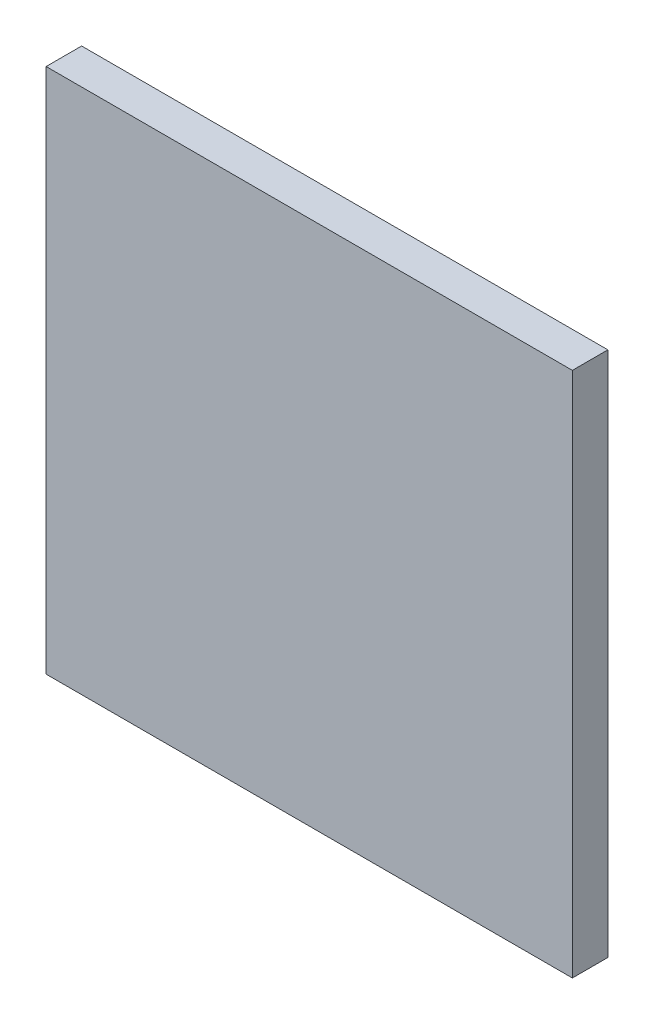
ISO-10303-21;
HEADER;
FILE_DESCRIPTION(('STEP AP214'),'2;1');
FILE_NAME('part.step','',(''),(''),'','','');
FILE_SCHEMA(('AUTOMOTIVE_DESIGN { 1 0 10303 214 1 1 1 1 }'));
ENDSEC;
DATA;
#1=APPLICATION_CONTEXT('core data for automotive mechanical design processes');
#2=APPLICATION_PROTOCOL_DEFINITION('international standard','automotive_design',2000,#1);
#3=PRODUCT_CONTEXT('',#1,'mechanical');
#4=PRODUCT('Part','Part','',(#3));
#5=PRODUCT_RELATED_PRODUCT_CATEGORY('part','',(#4));
#6=PRODUCT_DEFINITION_FORMATION('','',#4);
#7=PRODUCT_DEFINITION_CONTEXT('part definition',#1,'design');
#8=PRODUCT_DEFINITION('design','',#6,#7);
#9=PRODUCT_DEFINITION_SHAPE('','',#8);
#10=(LENGTH_UNIT() NAMED_UNIT(*) SI_UNIT(.MILLI.,.METRE.));
#11=(NAMED_UNIT(*) PLANE_ANGLE_UNIT() SI_UNIT($,.RADIAN.));
#12=(NAMED_UNIT(*) SI_UNIT($,.STERADIAN.) SOLID_ANGLE_UNIT());
#13=UNCERTAINTY_MEASURE_WITH_UNIT(LENGTH_MEASURE(1.E-05),#10,'distance_accuracy_value','');
#14=(GEOMETRIC_REPRESENTATION_CONTEXT(3) GLOBAL_UNCERTAINTY_ASSIGNED_CONTEXT((#13)) GLOBAL_UNIT_ASSIGNED_CONTEXT((#10,
#11,#12)) REPRESENTATION_CONTEXT('',''));
#15=CARTESIAN_POINT('',(0.,0.,0.));
#16=DIRECTION('',(0.,0.,1.));
#17=DIRECTION('',(1.,0.,0.));
#18=AXIS2_PLACEMENT_3D('',#15,#16,#17);
#19=CARTESIAN_POINT('',(1.5621,9.458706,0.76487));
#20=DIRECTION('',(0.,0.,-1.));
#21=DIRECTION('',(0.,1.,0.));
#22=AXIS2_PLACEMENT_3D('',#19,#20,#21);
#23=PLANE('',#22);
#24=DIRECTION('',(1.,0.,0.));
#25=VECTOR('',#24,1.);
#26=CARTESIAN_POINT('',(1.3081,9.712706,0.76487));
#27=LINE('',#26,#25);
#28=CARTESIAN_POINT('',(1.3081,9.712706,0.76487));
#29=VERTEX_POINT('',#28);
#30=CARTESIAN_POINT('',(1.8161,9.712706,0.76487));
#31=VERTEX_POINT('',#30);
#32=EDGE_CURVE('E55',#29,#31,#27,.T.);
#33=ORIENTED_EDGE('',*,*,#32,.T.);
#34=DIRECTION('',(0.,1.,0.));
#35=VECTOR('',#34,1.);
#36=CARTESIAN_POINT('',(1.8161,9.712706,0.76487));
#37=LINE('',#36,#35);
#38=CARTESIAN_POINT('',(1.8161,9.204706,0.76487));
#39=VERTEX_POINT('',#38);
#40=EDGE_CURVE('E57',#31,#39,#37,.F.);
#41=ORIENTED_EDGE('',*,*,#40,.T.);
#42=DIRECTION('',(1.,0.,0.));
#43=VECTOR('',#42,1.);
#44=CARTESIAN_POINT('',(1.8161,9.204706,0.76487));
#45=LINE('',#44,#43);
#46=CARTESIAN_POINT('',(1.3081,9.204706,0.76487));
#47=VERTEX_POINT('',#46);
#48=EDGE_CURVE('E20',#39,#47,#45,.F.);
#49=ORIENTED_EDGE('',*,*,#48,.T.);
#50=DIRECTION('',(0.,1.,0.));
#51=VECTOR('',#50,1.);
#52=CARTESIAN_POINT('',(1.3081,9.204706,0.76487));
#53=LINE('',#52,#51);
#54=EDGE_CURVE('E80',#47,#29,#53,.T.);
#55=ORIENTED_EDGE('',*,*,#54,.T.);
#56=EDGE_LOOP('',(#33,#41,#49,#55));
#57=FACE_BOUND('',#56,.T.);
#58=ADVANCED_FACE('F17',(#57),#23,.T.);
#59=CARTESIAN_POINT('',(1.8161,9.204706,0.76487));
#60=DIRECTION('',(0.,1.,0.));
#61=DIRECTION('',(0.,0.,1.));
#62=AXIS2_PLACEMENT_3D('',#59,#60,#61);
#63=PLANE('',#62);
#64=DIRECTION('',(0.,0.,1.));
#65=VECTOR('',#64,1.);
#66=CARTESIAN_POINT('',(1.3081,9.204706,0.76487));
#67=LINE('',#66,#65);
#68=CARTESIAN_POINT('',(1.3081,9.204706,0.79916));
#69=VERTEX_POINT('',#68);
#70=EDGE_CURVE('E68',#69,#47,#67,.F.);
#71=ORIENTED_EDGE('',*,*,#70,.T.);
#72=ORIENTED_EDGE('',*,*,#48,.F.);
#73=DIRECTION('',(0.,0.,1.));
#74=VECTOR('',#73,1.);
#75=CARTESIAN_POINT('',(1.8161,9.204706,0.76487));
#76=LINE('',#75,#74);
#77=CARTESIAN_POINT('',(1.8161,9.204706,0.79916));
#78=VERTEX_POINT('',#77);
#79=EDGE_CURVE('E63',#39,#78,#76,.T.);
#80=ORIENTED_EDGE('',*,*,#79,.T.);
#81=DIRECTION('',(1.,0.,0.));
#82=VECTOR('',#81,1.);
#83=CARTESIAN_POINT('',(1.5621,9.204706,0.79916));
#84=LINE('',#83,#82);
#85=EDGE_CURVE('E83',#69,#78,#84,.T.);
#86=ORIENTED_EDGE('',*,*,#85,.F.);
#87=EDGE_LOOP('',(#71,#72,#80,#86));
#88=FACE_BOUND('',#87,.T.);
#89=ADVANCED_FACE('F65',(#88),#63,.F.);
#90=CARTESIAN_POINT('',(1.8161,9.712706,0.76487));
#91=DIRECTION('',(-1.,0.,0.));
#92=DIRECTION('',(0.,0.,1.));
#93=AXIS2_PLACEMENT_3D('',#90,#91,#92);
#94=PLANE('',#93);
#95=ORIENTED_EDGE('',*,*,#79,.F.);
#96=ORIENTED_EDGE('',*,*,#40,.F.);
#97=DIRECTION('',(0.,0.,-1.));
#98=VECTOR('',#97,1.);
#99=CARTESIAN_POINT('',(1.8161,9.712706,0.76487));
#100=LINE('',#99,#98);
#101=CARTESIAN_POINT('',(1.8161,9.712706,0.79916));
#102=VERTEX_POINT('',#101);
#103=EDGE_CURVE('E75',#31,#102,#100,.F.);
#104=ORIENTED_EDGE('',*,*,#103,.T.);
#105=DIRECTION('',(0.,-1.,0.));
#106=VECTOR('',#105,1.);
#107=CARTESIAN_POINT('',(1.8161,9.458706,0.79916));
#108=LINE('',#107,#106);
#109=EDGE_CURVE('E72',#78,#102,#108,.F.);
#110=ORIENTED_EDGE('',*,*,#109,.F.);
#111=EDGE_LOOP('',(#95,#96,#104,#110));
#112=FACE_BOUND('',#111,.T.);
#113=ADVANCED_FACE('F70',(#112),#94,.F.);
#114=CARTESIAN_POINT('',(1.3081,9.712706,0.76487));
#115=DIRECTION('',(0.,-1.,0.));
#116=DIRECTION('',(0.,0.,-1.));
#117=AXIS2_PLACEMENT_3D('',#114,#115,#116);
#118=PLANE('',#117);
#119=ORIENTED_EDGE('',*,*,#103,.F.);
#120=ORIENTED_EDGE('',*,*,#32,.F.);
#121=DIRECTION('',(0.,0.,1.));
#122=VECTOR('',#121,1.);
#123=CARTESIAN_POINT('',(1.3081,9.712706,0.76487));
#124=LINE('',#123,#122);
#125=CARTESIAN_POINT('',(1.3081,9.712706,0.79916));
#126=VERTEX_POINT('',#125);
#127=EDGE_CURVE('E35',#29,#126,#124,.T.);
#128=ORIENTED_EDGE('',*,*,#127,.T.);
#129=DIRECTION('',(1.,0.,0.));
#130=VECTOR('',#129,1.);
#131=CARTESIAN_POINT('',(1.5621,9.712706,0.79916));
#132=LINE('',#131,#130);
#133=EDGE_CURVE('E26',#102,#126,#132,.F.);
#134=ORIENTED_EDGE('',*,*,#133,.F.);
#135=EDGE_LOOP('',(#119,#120,#128,#134));
#136=FACE_BOUND('',#135,.T.);
#137=ADVANCED_FACE('F89',(#136),#118,.F.);
#138=CARTESIAN_POINT('',(1.3081,9.204706,0.76487));
#139=DIRECTION('',(1.,0.,0.));
#140=DIRECTION('',(0.,1.,0.));
#141=AXIS2_PLACEMENT_3D('',#138,#139,#140);
#142=PLANE('',#141);
#143=ORIENTED_EDGE('',*,*,#127,.F.);
#144=ORIENTED_EDGE('',*,*,#54,.F.);
#145=ORIENTED_EDGE('',*,*,#70,.F.);
#146=DIRECTION('',(0.,-1.,0.));
#147=VECTOR('',#146,1.);
#148=CARTESIAN_POINT('',(1.3081,9.458706,0.79916));
#149=LINE('',#148,#147);
#150=EDGE_CURVE('E11',#126,#69,#149,.T.);
#151=ORIENTED_EDGE('',*,*,#150,.F.);
#152=EDGE_LOOP('',(#143,#144,#145,#151));
#153=FACE_BOUND('',#152,.T.);
#154=ADVANCED_FACE('F91',(#153),#142,.F.);
#155=CARTESIAN_POINT('',(1.5621,9.458706,0.79916));
#156=DIRECTION('',(0.,0.,1.));
#157=DIRECTION('',(0.,-1.,0.));
#158=AXIS2_PLACEMENT_3D('',#155,#156,#157);
#159=PLANE('',#158);
#160=ORIENTED_EDGE('',*,*,#133,.T.);
#161=ORIENTED_EDGE('',*,*,#150,.T.);
#162=ORIENTED_EDGE('',*,*,#85,.T.);
#163=ORIENTED_EDGE('',*,*,#109,.T.);
#164=EDGE_LOOP('',(#160,#161,#162,#163));
#165=FACE_BOUND('',#164,.T.);
#166=ADVANCED_FACE('F88',(#165),#159,.T.);
#167=CLOSED_SHELL('',(#58,#89,#113,#137,#154,#166));
#168=MANIFOLD_SOLID_BREP('B1',#167);
#169=ADVANCED_BREP_SHAPE_REPRESENTATION('',(#18,#168),#14);
#170=SHAPE_DEFINITION_REPRESENTATION(#9,#169);
ENDSEC;
END-ISO-10303-21;
